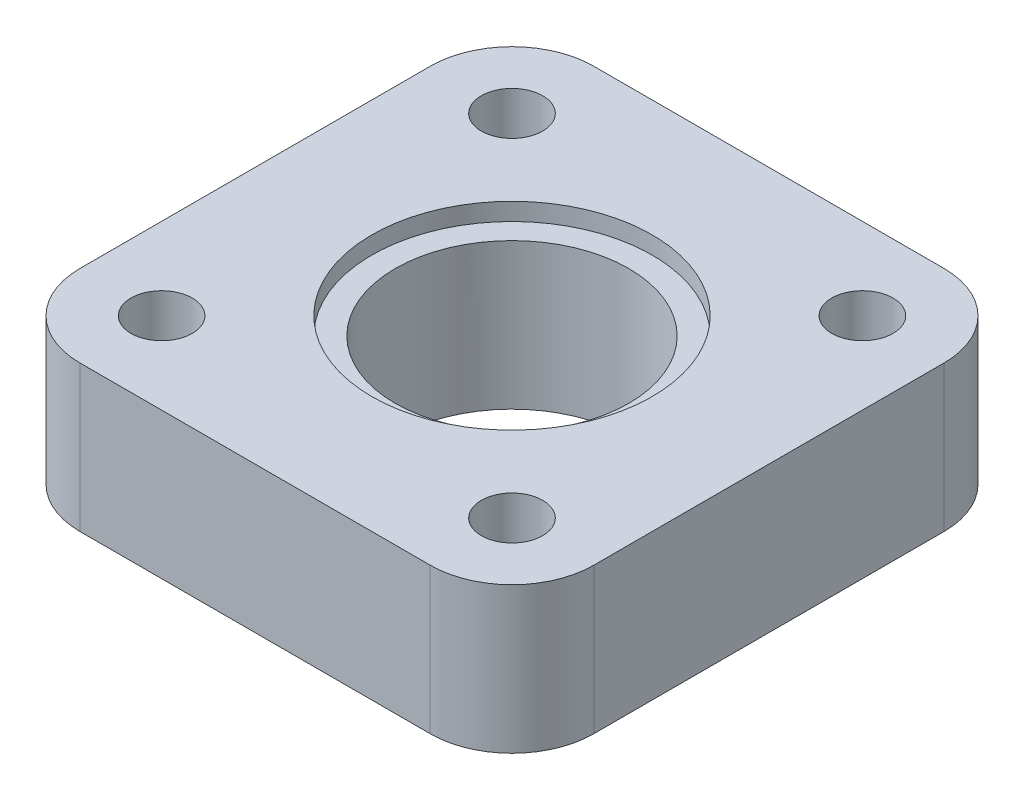
ISO-10303-21;
HEADER;
FILE_DESCRIPTION(('STEP AP214'),'2;1');
FILE_NAME('part.step','',(''),(''),'','','');
FILE_SCHEMA(('AUTOMOTIVE_DESIGN { 1 0 10303 214 1 1 1 1 }'));
ENDSEC;
DATA;
#1=APPLICATION_CONTEXT('core data for automotive mechanical design processes');
#2=APPLICATION_PROTOCOL_DEFINITION('international standard','automotive_design',2000,#1);
#3=PRODUCT_CONTEXT('',#1,'mechanical');
#4=PRODUCT('Part','Part','',(#3));
#5=PRODUCT_RELATED_PRODUCT_CATEGORY('part','',(#4));
#6=PRODUCT_DEFINITION_FORMATION('','',#4);
#7=PRODUCT_DEFINITION_CONTEXT('part definition',#1,'design');
#8=PRODUCT_DEFINITION('design','',#6,#7);
#9=PRODUCT_DEFINITION_SHAPE('','',#8);
#10=(LENGTH_UNIT() NAMED_UNIT(*) SI_UNIT(.MILLI.,.METRE.));
#11=(NAMED_UNIT(*) PLANE_ANGLE_UNIT() SI_UNIT($,.RADIAN.));
#12=(NAMED_UNIT(*) SI_UNIT($,.STERADIAN.) SOLID_ANGLE_UNIT());
#13=UNCERTAINTY_MEASURE_WITH_UNIT(LENGTH_MEASURE(1.E-05),#10,'distance_accuracy_value','');
#14=(GEOMETRIC_REPRESENTATION_CONTEXT(3) GLOBAL_UNCERTAINTY_ASSIGNED_CONTEXT((#13)) GLOBAL_UNIT_ASSIGNED_CONTEXT((#10,
#11,#12)) REPRESENTATION_CONTEXT('',''));
#15=CARTESIAN_POINT('',(0.,0.,0.));
#16=DIRECTION('',(0.,0.,1.));
#17=DIRECTION('',(1.,0.,0.));
#18=AXIS2_PLACEMENT_3D('',#15,#16,#17);
#19=CARTESIAN_POINT('',(-30.,0.,-30.));
#20=DIRECTION('',(0.,1.,0.));
#21=DIRECTION('',(0.,0.,1.));
#22=AXIS2_PLACEMENT_3D('',#19,#20,#21);
#23=PLANE('',#22);
#24=CARTESIAN_POINT('',(30.,0.,30.));
#25=DIRECTION('',(0.,1.,0.));
#26=DIRECTION('',(0.,0.,1.));
#27=AXIS2_PLACEMENT_3D('',#24,#25,#26);
#28=CIRCLE('',#27,5.25);
#29=CARTESIAN_POINT('',(30.,0.,35.25));
#30=VERTEX_POINT('',#29);
#31=EDGE_CURVE('E181',#30,#30,#28,.T.);
#32=ORIENTED_EDGE('',*,*,#31,.T.);
#33=EDGE_LOOP('',(#32));
#34=FACE_BOUND('',#33,.T.);
#35=CARTESIAN_POINT('',(-30.,0.,-30.));
#36=DIRECTION('',(0.,1.,0.));
#37=DIRECTION('',(0.,0.,1.));
#38=AXIS2_PLACEMENT_3D('',#35,#36,#37);
#39=CIRCLE('',#38,5.25);
#40=CARTESIAN_POINT('',(-30.,0.,-24.75));
#41=VERTEX_POINT('',#40);
#42=EDGE_CURVE('E192',#41,#41,#39,.T.);
#43=ORIENTED_EDGE('',*,*,#42,.T.);
#44=EDGE_LOOP('',(#43));
#45=FACE_BOUND('',#44,.T.);
#46=CARTESIAN_POINT('',(-30.,0.,-30.));
#47=DIRECTION('',(0.,1.,0.));
#48=DIRECTION('',(0.,0.,1.));
#49=AXIS2_PLACEMENT_3D('',#46,#47,#48);
#50=CIRCLE('',#49,14.0000000000001);
#51=CARTESIAN_POINT('',(-30.0000021759864,0.,-44.));
#52=VERTEX_POINT('',#51);
#53=CARTESIAN_POINT('',(-44.,0.,-30.));
#54=VERTEX_POINT('',#53);
#55=EDGE_CURVE('E132',#52,#54,#50,.T.);
#56=ORIENTED_EDGE('',*,*,#55,.F.);
#57=DIRECTION('',(-1.,0.,0.));
#58=VECTOR('',#57,1.);
#59=CARTESIAN_POINT('',(-30.0000021759864,0.,-44.));
#60=LINE('',#59,#58);
#61=CARTESIAN_POINT('',(30.,0.,-44.));
#62=VERTEX_POINT('',#61);
#63=EDGE_CURVE('E85',#62,#52,#60,.T.);
#64=ORIENTED_EDGE('',*,*,#63,.F.);
#65=CARTESIAN_POINT('',(30.,0.,-30.));
#66=DIRECTION('',(0.,1.,0.));
#67=DIRECTION('',(0.,0.,-1.));
#68=AXIS2_PLACEMENT_3D('',#65,#66,#67);
#69=CIRCLE('',#68,14.);
#70=CARTESIAN_POINT('',(44.,0.,-30.));
#71=VERTEX_POINT('',#70);
#72=EDGE_CURVE('E79',#71,#62,#69,.T.);
#73=ORIENTED_EDGE('',*,*,#72,.F.);
#74=DIRECTION('',(0.,0.,-1.));
#75=VECTOR('',#74,1.);
#76=CARTESIAN_POINT('',(44.,0.,-30.));
#77=LINE('',#76,#75);
#78=CARTESIAN_POINT('',(44.,0.,30.));
#79=VERTEX_POINT('',#78);
#80=EDGE_CURVE('E122',#79,#71,#77,.T.);
#81=ORIENTED_EDGE('',*,*,#80,.F.);
#82=CARTESIAN_POINT('',(30.,0.,30.));
#83=DIRECTION('',(0.,1.,0.));
#84=DIRECTION('',(0.,0.,1.));
#85=AXIS2_PLACEMENT_3D('',#82,#83,#84);
#86=CIRCLE('',#85,14.);
#87=CARTESIAN_POINT('',(30.,0.,44.));
#88=VERTEX_POINT('',#87);
#89=EDGE_CURVE('E142',#88,#79,#86,.T.);
#90=ORIENTED_EDGE('',*,*,#89,.F.);
#91=DIRECTION('',(1.,0.,0.));
#92=VECTOR('',#91,1.);
#93=CARTESIAN_POINT('',(-30.0000021759864,0.,44.));
#94=LINE('',#93,#92);
#95=CARTESIAN_POINT('',(-30.0000021759864,0.,44.));
#96=VERTEX_POINT('',#95);
#97=EDGE_CURVE('E140',#96,#88,#94,.T.);
#98=ORIENTED_EDGE('',*,*,#97,.F.);
#99=CARTESIAN_POINT('',(-30.,0.,30.));
#100=DIRECTION('',(0.,1.,0.));
#101=DIRECTION('',(0.,0.,1.));
#102=AXIS2_PLACEMENT_3D('',#99,#100,#101);
#103=CIRCLE('',#102,14.0000000000001);
#104=CARTESIAN_POINT('',(-44.0000000000001,0.,30.));
#105=VERTEX_POINT('',#104);
#106=EDGE_CURVE('E138',#105,#96,#103,.T.);
#107=ORIENTED_EDGE('',*,*,#106,.F.);
#108=DIRECTION('',(0.,0.,1.));
#109=VECTOR('',#108,1.);
#110=CARTESIAN_POINT('',(-44.,0.,-30.));
#111=LINE('',#110,#109);
#112=EDGE_CURVE('E135',#54,#105,#111,.T.);
#113=ORIENTED_EDGE('',*,*,#112,.F.);
#114=EDGE_LOOP('',(#56,#64,#73,#81,#90,#98,#107,#113));
#115=FACE_BOUND('',#114,.T.);
#116=CARTESIAN_POINT('',(30.,0.,-30.));
#117=DIRECTION('',(0.,1.,0.));
#118=DIRECTION('',(0.,0.,1.));
#119=AXIS2_PLACEMENT_3D('',#116,#117,#118);
#120=CIRCLE('',#119,5.25);
#121=CARTESIAN_POINT('',(30.,0.,-24.75));
#122=VERTEX_POINT('',#121);
#123=EDGE_CURVE('E186',#122,#122,#120,.T.);
#124=ORIENTED_EDGE('',*,*,#123,.T.);
#125=EDGE_LOOP('',(#124));
#126=FACE_BOUND('',#125,.T.);
#127=CARTESIAN_POINT('',(-30.,0.,30.));
#128=DIRECTION('',(0.,1.,0.));
#129=DIRECTION('',(0.,0.,1.));
#130=AXIS2_PLACEMENT_3D('',#127,#128,#129);
#131=CIRCLE('',#130,5.25);
#132=CARTESIAN_POINT('',(-30.,0.,35.25));
#133=VERTEX_POINT('',#132);
#134=EDGE_CURVE('E162',#133,#133,#131,.T.);
#135=ORIENTED_EDGE('',*,*,#134,.T.);
#136=EDGE_LOOP('',(#135));
#137=FACE_BOUND('',#136,.T.);
#138=CARTESIAN_POINT('',(0.,0.,0.));
#139=DIRECTION('',(0.,1.,0.));
#140=DIRECTION('',(0.,0.,1.));
#141=AXIS2_PLACEMENT_3D('',#138,#139,#140);
#142=CIRCLE('',#141,23.5);
#143=CARTESIAN_POINT('',(0.,0.,23.5));
#144=VERTEX_POINT('',#143);
#145=EDGE_CURVE('E11',#144,#144,#142,.F.);
#146=ORIENTED_EDGE('',*,*,#145,.F.);
#147=EDGE_LOOP('',(#146));
#148=FACE_BOUND('',#147,.T.);
#149=ADVANCED_FACE('F33',(#34,#45,#115,#126,#137,#148),#23,.F.);
#150=CARTESIAN_POINT('',(0.,25.,0.));
#151=DIRECTION('',(0.,-1.,0.));
#152=DIRECTION('',(0.,0.,-1.));
#153=AXIS2_PLACEMENT_3D('',#150,#151,#152);
#154=CYLINDRICAL_SURFACE('',#153,20.);
#155=CARTESIAN_POINT('',(0.,22.,0.));
#156=DIRECTION('',(0.,1.,0.));
#157=DIRECTION('',(0.,0.,1.));
#158=AXIS2_PLACEMENT_3D('',#155,#156,#157);
#159=CIRCLE('',#158,20.);
#160=CARTESIAN_POINT('',(0.,22.,20.));
#161=VERTEX_POINT('',#160);
#162=EDGE_CURVE('E160',#161,#161,#159,.T.);
#163=ORIENTED_EDGE('',*,*,#162,.T.);
#164=EDGE_LOOP('',(#163));
#165=FACE_BOUND('',#164,.T.);
#166=CARTESIAN_POINT('',(0.,-3.,0.));
#167=DIRECTION('',(0.,-1.,0.));
#168=DIRECTION('',(0.,0.,-1.));
#169=AXIS2_PLACEMENT_3D('',#166,#167,#168);
#170=CIRCLE('',#169,20.);
#171=CARTESIAN_POINT('',(0.,-3.,-20.));
#172=VERTEX_POINT('',#171);
#173=EDGE_CURVE('E279',#172,#172,#170,.T.);
#174=ORIENTED_EDGE('',*,*,#173,.T.);
#175=EDGE_LOOP('',(#174));
#176=FACE_BOUND('',#175,.T.);
#177=ADVANCED_FACE('F235',(#165,#176),#154,.F.);
#178=CARTESIAN_POINT('',(-30.,25.,-30.));
#179=DIRECTION('',(0.,1.,0.));
#180=DIRECTION('',(0.,0.,1.));
#181=AXIS2_PLACEMENT_3D('',#178,#179,#180);
#182=PLANE('',#181);
#183=CARTESIAN_POINT('',(0.,25.,0.));
#184=DIRECTION('',(0.,1.,0.));
#185=DIRECTION('',(0.,0.,1.));
#186=AXIS2_PLACEMENT_3D('',#183,#184,#185);
#187=CIRCLE('',#186,24.);
#188=CARTESIAN_POINT('',(0.,25.,24.));
#189=VERTEX_POINT('',#188);
#190=EDGE_CURVE('E170',#189,#189,#187,.T.);
#191=ORIENTED_EDGE('',*,*,#190,.F.);
#192=EDGE_LOOP('',(#191));
#193=FACE_BOUND('',#192,.T.);
#194=CARTESIAN_POINT('',(-30.,25.,30.));
#195=DIRECTION('',(0.,1.,0.));
#196=DIRECTION('',(0.,0.,1.));
#197=AXIS2_PLACEMENT_3D('',#194,#195,#196);
#198=CIRCLE('',#197,5.25);
#199=CARTESIAN_POINT('',(-30.,25.,35.25));
#200=VERTEX_POINT('',#199);
#201=EDGE_CURVE('E167',#200,#200,#198,.T.);
#202=ORIENTED_EDGE('',*,*,#201,.F.);
#203=EDGE_LOOP('',(#202));
#204=FACE_BOUND('',#203,.T.);
#205=CARTESIAN_POINT('',(30.,25.,-30.));
#206=DIRECTION('',(0.,1.,0.));
#207=DIRECTION('',(0.,0.,1.));
#208=AXIS2_PLACEMENT_3D('',#205,#206,#207);
#209=CIRCLE('',#208,5.25);
#210=CARTESIAN_POINT('',(30.,25.,-24.75));
#211=VERTEX_POINT('',#210);
#212=EDGE_CURVE('E189',#211,#211,#209,.T.);
#213=ORIENTED_EDGE('',*,*,#212,.F.);
#214=EDGE_LOOP('',(#213));
#215=FACE_BOUND('',#214,.T.);
#216=CARTESIAN_POINT('',(-30.,25.,-30.));
#217=DIRECTION('',(0.,1.,0.));
#218=DIRECTION('',(0.,0.,1.));
#219=AXIS2_PLACEMENT_3D('',#216,#217,#218);
#220=CIRCLE('',#219,14.0000000000001);
#221=CARTESIAN_POINT('',(-30.0000021759864,25.,-44.));
#222=VERTEX_POINT('',#221);
#223=CARTESIAN_POINT('',(-44.,25.,-30.));
#224=VERTEX_POINT('',#223);
#225=EDGE_CURVE('E147',#222,#224,#220,.T.);
#226=ORIENTED_EDGE('',*,*,#225,.T.);
#227=DIRECTION('',(0.,0.,1.));
#228=VECTOR('',#227,1.);
#229=CARTESIAN_POINT('',(-44.,25.,-30.));
#230=LINE('',#229,#228);
#231=CARTESIAN_POINT('',(-44.0000000000001,25.,30.));
#232=VERTEX_POINT('',#231);
#233=EDGE_CURVE('E94',#224,#232,#230,.T.);
#234=ORIENTED_EDGE('',*,*,#233,.T.);
#235=CARTESIAN_POINT('',(-30.,25.,30.));
#236=DIRECTION('',(0.,1.,0.));
#237=DIRECTION('',(0.,0.,1.));
#238=AXIS2_PLACEMENT_3D('',#235,#236,#237);
#239=CIRCLE('',#238,14.0000000000001);
#240=CARTESIAN_POINT('',(-30.0000021759864,25.,44.));
#241=VERTEX_POINT('',#240);
#242=EDGE_CURVE('E201',#232,#241,#239,.T.);
#243=ORIENTED_EDGE('',*,*,#242,.T.);
#244=DIRECTION('',(1.,0.,0.));
#245=VECTOR('',#244,1.);
#246=CARTESIAN_POINT('',(-30.0000021759864,25.,44.));
#247=LINE('',#246,#245);
#248=CARTESIAN_POINT('',(30.,25.,44.));
#249=VERTEX_POINT('',#248);
#250=EDGE_CURVE('E203',#241,#249,#247,.T.);
#251=ORIENTED_EDGE('',*,*,#250,.T.);
#252=CARTESIAN_POINT('',(30.,25.,30.));
#253=DIRECTION('',(0.,1.,0.));
#254=DIRECTION('',(0.,0.,1.));
#255=AXIS2_PLACEMENT_3D('',#252,#253,#254);
#256=CIRCLE('',#255,14.);
#257=CARTESIAN_POINT('',(44.,25.,30.));
#258=VERTEX_POINT('',#257);
#259=EDGE_CURVE('E114',#249,#258,#256,.T.);
#260=ORIENTED_EDGE('',*,*,#259,.T.);
#261=DIRECTION('',(0.,0.,-1.));
#262=VECTOR('',#261,1.);
#263=CARTESIAN_POINT('',(44.,25.,-30.));
#264=LINE('',#263,#262);
#265=CARTESIAN_POINT('',(44.,25.,-30.));
#266=VERTEX_POINT('',#265);
#267=EDGE_CURVE('E107',#258,#266,#264,.T.);
#268=ORIENTED_EDGE('',*,*,#267,.T.);
#269=CARTESIAN_POINT('',(30.,25.,-30.));
#270=DIRECTION('',(0.,1.,0.));
#271=DIRECTION('',(0.,0.,-1.));
#272=AXIS2_PLACEMENT_3D('',#269,#270,#271);
#273=CIRCLE('',#272,14.);
#274=CARTESIAN_POINT('',(30.,25.,-44.));
#275=VERTEX_POINT('',#274);
#276=EDGE_CURVE('E112',#266,#275,#273,.T.);
#277=ORIENTED_EDGE('',*,*,#276,.T.);
#278=DIRECTION('',(-1.,0.,0.));
#279=VECTOR('',#278,1.);
#280=CARTESIAN_POINT('',(-30.0000021759864,25.,-44.));
#281=LINE('',#280,#279);
#282=EDGE_CURVE('E50',#275,#222,#281,.T.);
#283=ORIENTED_EDGE('',*,*,#282,.T.);
#284=EDGE_LOOP('',(#226,#234,#243,#251,#260,#268,#277,#283));
#285=FACE_BOUND('',#284,.T.);
#286=CARTESIAN_POINT('',(-30.,25.,-30.));
#287=DIRECTION('',(0.,1.,0.));
#288=DIRECTION('',(0.,0.,1.));
#289=AXIS2_PLACEMENT_3D('',#286,#287,#288);
#290=CIRCLE('',#289,5.25);
#291=CARTESIAN_POINT('',(-30.,25.,-24.75));
#292=VERTEX_POINT('',#291);
#293=EDGE_CURVE('E136',#292,#292,#290,.T.);
#294=ORIENTED_EDGE('',*,*,#293,.F.);
#295=EDGE_LOOP('',(#294));
#296=FACE_BOUND('',#295,.T.);
#297=CARTESIAN_POINT('',(30.,25.,30.));
#298=DIRECTION('',(0.,1.,0.));
#299=DIRECTION('',(0.,0.,1.));
#300=AXIS2_PLACEMENT_3D('',#297,#298,#299);
#301=CIRCLE('',#300,5.25);
#302=CARTESIAN_POINT('',(30.,25.,35.25));
#303=VERTEX_POINT('',#302);
#304=EDGE_CURVE('E183',#303,#303,#301,.T.);
#305=ORIENTED_EDGE('',*,*,#304,.F.);
#306=EDGE_LOOP('',(#305));
#307=FACE_BOUND('',#306,.T.);
#308=ADVANCED_FACE('F109',(#193,#204,#215,#285,#296,#307),#182,.T.);
#309=CARTESIAN_POINT('',(-30.,25.,-30.));
#310=DIRECTION('',(0.,-1.,0.));
#311=DIRECTION('',(0.,0.,-1.));
#312=AXIS2_PLACEMENT_3D('',#309,#310,#311);
#313=CYLINDRICAL_SURFACE('',#312,14.0000000000001);
#314=ORIENTED_EDGE('',*,*,#55,.T.);
#315=DIRECTION('',(0.,-1.,0.));
#316=VECTOR('',#315,1.);
#317=CARTESIAN_POINT('',(-44.,25.,-30.));
#318=LINE('',#317,#316);
#319=EDGE_CURVE('E42',#224,#54,#318,.T.);
#320=ORIENTED_EDGE('',*,*,#319,.F.);
#321=ORIENTED_EDGE('',*,*,#225,.F.);
#322=DIRECTION('',(0.,-1.,0.));
#323=VECTOR('',#322,1.);
#324=CARTESIAN_POINT('',(-30.0000021759864,25.,-44.));
#325=LINE('',#324,#323);
#326=EDGE_CURVE('E128',#222,#52,#325,.T.);
#327=ORIENTED_EDGE('',*,*,#326,.T.);
#328=EDGE_LOOP('',(#314,#320,#321,#327));
#329=FACE_BOUND('',#328,.T.);
#330=ADVANCED_FACE('F35',(#329),#313,.T.);
#331=CARTESIAN_POINT('',(-44.,25.,-30.));
#332=DIRECTION('',(1.,0.,0.));
#333=DIRECTION('',(0.,0.,-1.));
#334=AXIS2_PLACEMENT_3D('',#331,#332,#333);
#335=PLANE('',#334);
#336=ORIENTED_EDGE('',*,*,#112,.T.);
#337=DIRECTION('',(0.,-1.,0.));
#338=VECTOR('',#337,1.);
#339=CARTESIAN_POINT('',(-44.0000000000001,25.,30.));
#340=LINE('',#339,#338);
#341=EDGE_CURVE('E157',#232,#105,#340,.T.);
#342=ORIENTED_EDGE('',*,*,#341,.F.);
#343=ORIENTED_EDGE('',*,*,#233,.F.);
#344=ORIENTED_EDGE('',*,*,#319,.T.);
#345=EDGE_LOOP('',(#336,#342,#343,#344));
#346=FACE_BOUND('',#345,.T.);
#347=ADVANCED_FACE('F390',(#346),#335,.F.);
#348=CARTESIAN_POINT('',(-30.,25.,30.));
#349=DIRECTION('',(0.,-1.,0.));
#350=DIRECTION('',(0.,0.,-1.));
#351=AXIS2_PLACEMENT_3D('',#348,#349,#350);
#352=CYLINDRICAL_SURFACE('',#351,14.0000000000001);
#353=ORIENTED_EDGE('',*,*,#106,.T.);
#354=DIRECTION('',(0.,-1.,0.));
#355=VECTOR('',#354,1.);
#356=CARTESIAN_POINT('',(-30.0000021759864,25.,44.));
#357=LINE('',#356,#355);
#358=EDGE_CURVE('E154',#241,#96,#357,.T.);
#359=ORIENTED_EDGE('',*,*,#358,.F.);
#360=ORIENTED_EDGE('',*,*,#242,.F.);
#361=ORIENTED_EDGE('',*,*,#341,.T.);
#362=EDGE_LOOP('',(#353,#359,#360,#361));
#363=FACE_BOUND('',#362,.T.);
#364=ADVANCED_FACE('F381',(#363),#352,.T.);
#365=CARTESIAN_POINT('',(-30.0000021759864,25.,44.));
#366=DIRECTION('',(0.,0.,-1.));
#367=DIRECTION('',(-1.,0.,0.));
#368=AXIS2_PLACEMENT_3D('',#365,#366,#367);
#369=PLANE('',#368);
#370=ORIENTED_EDGE('',*,*,#97,.T.);
#371=DIRECTION('',(0.,-1.,0.));
#372=VECTOR('',#371,1.);
#373=CARTESIAN_POINT('',(30.,25.,44.));
#374=LINE('',#373,#372);
#375=EDGE_CURVE('E151',#249,#88,#374,.T.);
#376=ORIENTED_EDGE('',*,*,#375,.F.);
#377=ORIENTED_EDGE('',*,*,#250,.F.);
#378=ORIENTED_EDGE('',*,*,#358,.T.);
#379=EDGE_LOOP('',(#370,#376,#377,#378));
#380=FACE_BOUND('',#379,.T.);
#381=ADVANCED_FACE('F209',(#380),#369,.F.);
#382=CARTESIAN_POINT('',(30.,25.,30.));
#383=DIRECTION('',(0.,-1.,0.));
#384=DIRECTION('',(0.,0.,-1.));
#385=AXIS2_PLACEMENT_3D('',#382,#383,#384);
#386=CYLINDRICAL_SURFACE('',#385,14.);
#387=ORIENTED_EDGE('',*,*,#89,.T.);
#388=DIRECTION('',(0.,-1.,0.));
#389=VECTOR('',#388,1.);
#390=CARTESIAN_POINT('',(44.,25.,30.));
#391=LINE('',#390,#389);
#392=EDGE_CURVE('E123',#258,#79,#391,.T.);
#393=ORIENTED_EDGE('',*,*,#392,.F.);
#394=ORIENTED_EDGE('',*,*,#259,.F.);
#395=ORIENTED_EDGE('',*,*,#375,.T.);
#396=EDGE_LOOP('',(#387,#393,#394,#395));
#397=FACE_BOUND('',#396,.T.);
#398=ADVANCED_FACE('F213',(#397),#386,.T.);
#399=CARTESIAN_POINT('',(44.,25.,-30.));
#400=DIRECTION('',(-1.,0.,0.));
#401=DIRECTION('',(0.,0.,1.));
#402=AXIS2_PLACEMENT_3D('',#399,#400,#401);
#403=PLANE('',#402);
#404=ORIENTED_EDGE('',*,*,#80,.T.);
#405=DIRECTION('',(0.,-1.,0.));
#406=VECTOR('',#405,1.);
#407=CARTESIAN_POINT('',(44.,25.,-30.));
#408=LINE('',#407,#406);
#409=EDGE_CURVE('E119',#266,#71,#408,.T.);
#410=ORIENTED_EDGE('',*,*,#409,.F.);
#411=ORIENTED_EDGE('',*,*,#267,.F.);
#412=ORIENTED_EDGE('',*,*,#392,.T.);
#413=EDGE_LOOP('',(#404,#410,#411,#412));
#414=FACE_BOUND('',#413,.T.);
#415=ADVANCED_FACE('F120',(#414),#403,.F.);
#416=CARTESIAN_POINT('',(30.,25.,-30.));
#417=DIRECTION('',(0.,-1.,0.));
#418=DIRECTION('',(0.,0.,-1.));
#419=AXIS2_PLACEMENT_3D('',#416,#417,#418);
#420=CYLINDRICAL_SURFACE('',#419,14.);
#421=ORIENTED_EDGE('',*,*,#72,.T.);
#422=DIRECTION('',(0.,-1.,0.));
#423=VECTOR('',#422,1.);
#424=CARTESIAN_POINT('',(30.,25.,-44.));
#425=LINE('',#424,#423);
#426=EDGE_CURVE('E124',#275,#62,#425,.T.);
#427=ORIENTED_EDGE('',*,*,#426,.F.);
#428=ORIENTED_EDGE('',*,*,#276,.F.);
#429=ORIENTED_EDGE('',*,*,#409,.T.);
#430=EDGE_LOOP('',(#421,#427,#428,#429));
#431=FACE_BOUND('',#430,.T.);
#432=ADVANCED_FACE('F126',(#431),#420,.T.);
#433=CARTESIAN_POINT('',(-30.0000021759864,25.,-44.));
#434=DIRECTION('',(0.,0.,1.));
#435=DIRECTION('',(1.,0.,0.));
#436=AXIS2_PLACEMENT_3D('',#433,#434,#435);
#437=PLANE('',#436);
#438=ORIENTED_EDGE('',*,*,#63,.T.);
#439=ORIENTED_EDGE('',*,*,#326,.F.);
#440=ORIENTED_EDGE('',*,*,#282,.F.);
#441=ORIENTED_EDGE('',*,*,#426,.T.);
#442=EDGE_LOOP('',(#438,#439,#440,#441));
#443=FACE_BOUND('',#442,.T.);
#444=ADVANCED_FACE('F221',(#443),#437,.F.);
#445=CARTESIAN_POINT('',(-30.,25.,-30.));
#446=DIRECTION('',(0.,-1.,0.));
#447=DIRECTION('',(0.,0.,-1.));
#448=AXIS2_PLACEMENT_3D('',#445,#446,#447);
#449=CYLINDRICAL_SURFACE('',#448,5.25);
#450=ORIENTED_EDGE('',*,*,#293,.T.);
#451=EDGE_LOOP('',(#450));
#452=FACE_BOUND('',#451,.T.);
#453=ORIENTED_EDGE('',*,*,#42,.F.);
#454=EDGE_LOOP('',(#453));
#455=FACE_BOUND('',#454,.T.);
#456=ADVANCED_FACE('F223',(#452,#455),#449,.F.);
#457=CARTESIAN_POINT('',(30.,25.,-30.));
#458=DIRECTION('',(0.,-1.,0.));
#459=DIRECTION('',(0.,0.,-1.));
#460=AXIS2_PLACEMENT_3D('',#457,#458,#459);
#461=CYLINDRICAL_SURFACE('',#460,5.25);
#462=ORIENTED_EDGE('',*,*,#212,.T.);
#463=EDGE_LOOP('',(#462));
#464=FACE_BOUND('',#463,.T.);
#465=ORIENTED_EDGE('',*,*,#123,.F.);
#466=EDGE_LOOP('',(#465));
#467=FACE_BOUND('',#466,.T.);
#468=ADVANCED_FACE('F229',(#464,#467),#461,.F.);
#469=CARTESIAN_POINT('',(30.,25.,30.));
#470=DIRECTION('',(0.,-1.,0.));
#471=DIRECTION('',(0.,0.,-1.));
#472=AXIS2_PLACEMENT_3D('',#469,#470,#471);
#473=CYLINDRICAL_SURFACE('',#472,5.25);
#474=ORIENTED_EDGE('',*,*,#304,.T.);
#475=EDGE_LOOP('',(#474));
#476=FACE_BOUND('',#475,.T.);
#477=ORIENTED_EDGE('',*,*,#31,.F.);
#478=EDGE_LOOP('',(#477));
#479=FACE_BOUND('',#478,.T.);
#480=ADVANCED_FACE('F248',(#476,#479),#473,.F.);
#481=CARTESIAN_POINT('',(-30.,25.,30.));
#482=DIRECTION('',(0.,-1.,0.));
#483=DIRECTION('',(0.,0.,-1.));
#484=AXIS2_PLACEMENT_3D('',#481,#482,#483);
#485=CYLINDRICAL_SURFACE('',#484,5.25);
#486=ORIENTED_EDGE('',*,*,#201,.T.);
#487=EDGE_LOOP('',(#486));
#488=FACE_BOUND('',#487,.T.);
#489=ORIENTED_EDGE('',*,*,#134,.F.);
#490=EDGE_LOOP('',(#489));
#491=FACE_BOUND('',#490,.T.);
#492=ADVANCED_FACE('F252',(#488,#491),#485,.F.);
#493=CARTESIAN_POINT('',(0.,22.,0.));
#494=DIRECTION('',(0.,1.,0.));
#495=DIRECTION('',(0.,0.,1.));
#496=AXIS2_PLACEMENT_3D('',#493,#494,#495);
#497=CYLINDRICAL_SURFACE('',#496,24.);
#498=CARTESIAN_POINT('',(0.,22.,0.));
#499=DIRECTION('',(0.,1.,0.));
#500=DIRECTION('',(0.,0.,1.));
#501=AXIS2_PLACEMENT_3D('',#498,#499,#500);
#502=CIRCLE('',#501,24.);
#503=CARTESIAN_POINT('',(0.,22.,24.));
#504=VERTEX_POINT('',#503);
#505=EDGE_CURVE('E163',#504,#504,#502,.T.);
#506=ORIENTED_EDGE('',*,*,#505,.F.);
#507=EDGE_LOOP('',(#506));
#508=FACE_BOUND('',#507,.T.);
#509=ORIENTED_EDGE('',*,*,#190,.T.);
#510=EDGE_LOOP('',(#509));
#511=FACE_BOUND('',#510,.T.);
#512=ADVANCED_FACE('F255',(#508,#511),#497,.F.);
#513=CARTESIAN_POINT('',(0.,22.,0.));
#514=DIRECTION('',(0.,1.,0.));
#515=DIRECTION('',(0.,0.,1.));
#516=AXIS2_PLACEMENT_3D('',#513,#514,#515);
#517=PLANE('',#516);
#518=ORIENTED_EDGE('',*,*,#162,.F.);
#519=EDGE_LOOP('',(#518));
#520=FACE_BOUND('',#519,.T.);
#521=ORIENTED_EDGE('',*,*,#505,.T.);
#522=EDGE_LOOP('',(#521));
#523=FACE_BOUND('',#522,.T.);
#524=ADVANCED_FACE('F260',(#520,#523),#517,.T.);
#525=CARTESIAN_POINT('',(0.,-3.,0.));
#526=DIRECTION('',(0.,-1.,0.));
#527=DIRECTION('',(0.,0.,-1.));
#528=AXIS2_PLACEMENT_3D('',#525,#526,#527);
#529=PLANE('',#528);
#530=CARTESIAN_POINT('',(0.,-3.,0.));
#531=DIRECTION('',(0.,-1.,0.));
#532=DIRECTION('',(0.,0.,-1.));
#533=AXIS2_PLACEMENT_3D('',#530,#531,#532);
#534=CIRCLE('',#533,23.5);
#535=CARTESIAN_POINT('',(0.,-3.,-23.5));
#536=VERTEX_POINT('',#535);
#537=EDGE_CURVE('E175',#536,#536,#534,.T.);
#538=ORIENTED_EDGE('',*,*,#537,.T.);
#539=EDGE_LOOP('',(#538));
#540=FACE_BOUND('',#539,.T.);
#541=ORIENTED_EDGE('',*,*,#173,.F.);
#542=EDGE_LOOP('',(#541));
#543=FACE_BOUND('',#542,.T.);
#544=ADVANCED_FACE('F264',(#540,#543),#529,.T.);
#545=CARTESIAN_POINT('',(0.,-3.,0.));
#546=DIRECTION('',(0.,1.,0.));
#547=DIRECTION('',(0.,0.,1.));
#548=AXIS2_PLACEMENT_3D('',#545,#546,#547);
#549=CYLINDRICAL_SURFACE('',#548,23.5);
#550=ORIENTED_EDGE('',*,*,#537,.F.);
#551=EDGE_LOOP('',(#550));
#552=FACE_BOUND('',#551,.T.);
#553=ORIENTED_EDGE('',*,*,#145,.T.);
#554=EDGE_LOOP('',(#553));
#555=FACE_BOUND('',#554,.T.);
#556=ADVANCED_FACE('F266',(#552,#555),#549,.T.);
#557=CLOSED_SHELL('',(#149,#177,#308,#330,#347,#364,#381,#398,#415,#432,#444,#456,#468,#480,
#492,#512,#524,#544,#556));
#558=MANIFOLD_SOLID_BREP('B2',#557);
#559=ADVANCED_BREP_SHAPE_REPRESENTATION('',(#18,#558),#14);
#560=SHAPE_DEFINITION_REPRESENTATION(#9,#559);
ENDSEC;
END-ISO-10303-21;
